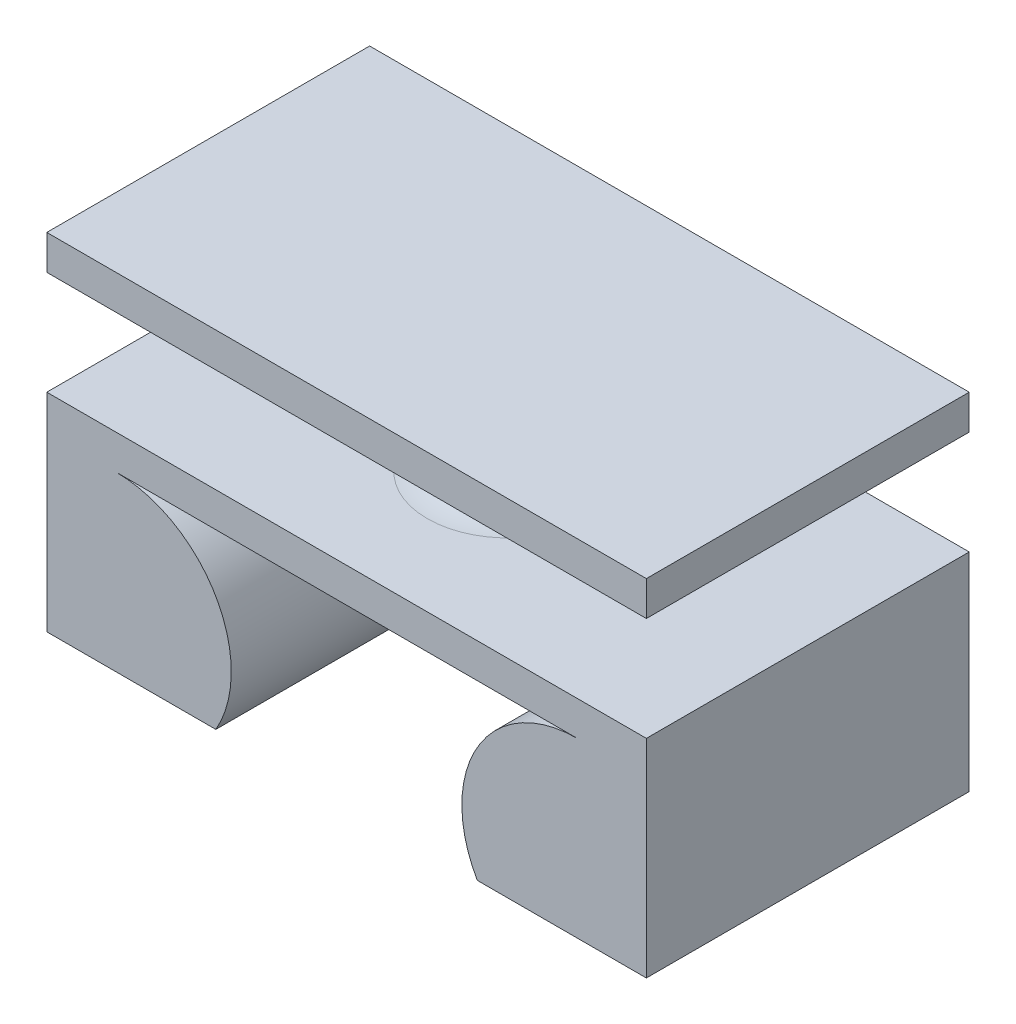
ISO-10303-21;
HEADER;
FILE_DESCRIPTION(('STEP AP214'),'2;1');
FILE_NAME('part.step','',(''),(''),'','','');
FILE_SCHEMA(('AUTOMOTIVE_DESIGN { 1 0 10303 214 1 1 1 1 }'));
ENDSEC;
DATA;
#1=APPLICATION_CONTEXT('core data for automotive mechanical design processes');
#2=APPLICATION_PROTOCOL_DEFINITION('international standard','automotive_design',2000,#1);
#3=PRODUCT_CONTEXT('',#1,'mechanical');
#4=PRODUCT('Part','Part','',(#3));
#5=PRODUCT_RELATED_PRODUCT_CATEGORY('part','',(#4));
#6=PRODUCT_DEFINITION_FORMATION('','',#4);
#7=PRODUCT_DEFINITION_CONTEXT('part definition',#1,'design');
#8=PRODUCT_DEFINITION('design','',#6,#7);
#9=PRODUCT_DEFINITION_SHAPE('','',#8);
#10=(LENGTH_UNIT() NAMED_UNIT(*) SI_UNIT(.MILLI.,.METRE.));
#11=(NAMED_UNIT(*) PLANE_ANGLE_UNIT() SI_UNIT($,.RADIAN.));
#12=(NAMED_UNIT(*) SI_UNIT($,.STERADIAN.) SOLID_ANGLE_UNIT());
#13=UNCERTAINTY_MEASURE_WITH_UNIT(LENGTH_MEASURE(1.E-05),#10,'distance_accuracy_value','');
#14=(GEOMETRIC_REPRESENTATION_CONTEXT(3) GLOBAL_UNCERTAINTY_ASSIGNED_CONTEXT((#13)) GLOBAL_UNIT_ASSIGNED_CONTEXT((#10,
#11,#12)) REPRESENTATION_CONTEXT('',''));
#15=CARTESIAN_POINT('',(0.,0.,0.));
#16=DIRECTION('',(0.,0.,1.));
#17=DIRECTION('',(1.,0.,0.));
#18=AXIS2_PLACEMENT_3D('',#15,#16,#17);
#19=CARTESIAN_POINT('',(5.00000000000001,-0.999999999999966,3.5));
#20=DIRECTION('',(0.,0.,-1.));
#21=DIRECTION('',(-1.,0.,0.));
#22=AXIS2_PLACEMENT_3D('',#19,#20,#21);
#23=CYLINDRICAL_SURFACE('',#22,2.49999999999998);
#24=CARTESIAN_POINT('',(5.00000000000001,-0.999999999999983,-5.));
#25=DIRECTION('',(-0.707106781186547,0.,-0.707106781186547));
#26=DIRECTION('',(0.707106781186547,0.,-0.707106781186547));
#27=AXIS2_PLACEMENT_3D('',#24,#25,#26);
#28=ELLIPSE('',#27,3.53553390593272,2.49999999999999);
#29=CARTESIAN_POINT('',(2.83493649053895,-2.25,-2.8349364905389));
#30=VERTEX_POINT('',#29);
#31=CARTESIAN_POINT('',(3.5,0.999999999999999,-3.5));
#32=VERTEX_POINT('',#31);
#33=EDGE_CURVE('E56',#30,#32,#28,.T.);
#34=ORIENTED_EDGE('',*,*,#33,.F.);
#35=DIRECTION('',(0.,0.,-1.));
#36=VECTOR('',#35,1.);
#37=CARTESIAN_POINT('',(2.83493649053895,-2.25,3.5));
#38=LINE('',#37,#36);
#39=CARTESIAN_POINT('',(2.83493649053895,-2.25,3.5));
#40=VERTEX_POINT('',#39);
#41=EDGE_CURVE('E49',#40,#30,#38,.T.);
#42=ORIENTED_EDGE('',*,*,#41,.F.);
#43=CARTESIAN_POINT('',(5.00000000000001,-0.999999999999966,3.5));
#44=DIRECTION('',(0.,0.,1.));
#45=DIRECTION('',(1.,0.,0.));
#46=AXIS2_PLACEMENT_3D('',#43,#44,#45);
#47=CIRCLE('',#46,2.49999999999998);
#48=CARTESIAN_POINT('',(5.,1.5,3.5));
#49=VERTEX_POINT('',#48);
#50=EDGE_CURVE('E186',#40,#49,#47,.F.);
#51=ORIENTED_EDGE('',*,*,#50,.T.);
#52=DIRECTION('',(0.,0.,-1.));
#53=VECTOR('',#52,1.);
#54=CARTESIAN_POINT('',(5.,1.5,3.5));
#55=LINE('',#54,#53);
#56=CARTESIAN_POINT('',(5.,1.5,-3.5));
#57=VERTEX_POINT('',#56);
#58=EDGE_CURVE('E212',#49,#57,#55,.T.);
#59=ORIENTED_EDGE('',*,*,#58,.T.);
#60=CARTESIAN_POINT('',(5.00000000000001,-0.999999999999966,-3.5));
#61=DIRECTION('',(0.,0.,1.));
#62=DIRECTION('',(1.,0.,0.));
#63=AXIS2_PLACEMENT_3D('',#60,#61,#62);
#64=CIRCLE('',#63,2.49999999999998);
#65=EDGE_CURVE('E185',#32,#57,#64,.F.);
#66=ORIENTED_EDGE('',*,*,#65,.F.);
#67=EDGE_LOOP('',(#34,#42,#51,#59,#66));
#68=FACE_BOUND('',#67,.T.);
#69=ADVANCED_FACE('F41',(#68),#23,.T.);
#70=CARTESIAN_POINT('',(6.5,0.,3.5));
#71=DIRECTION('',(1.,0.,0.));
#72=DIRECTION('',(0.,1.,0.));
#73=AXIS2_PLACEMENT_3D('',#70,#71,#72);
#74=PLANE('',#73);
#75=DIRECTION('',(0.,-1.,0.));
#76=VECTOR('',#75,1.);
#77=CARTESIAN_POINT('',(6.5,0.,-3.5));
#78=LINE('',#77,#76);
#79=CARTESIAN_POINT('',(6.5,2.25,-3.5));
#80=VERTEX_POINT('',#79);
#81=CARTESIAN_POINT('',(6.5,-2.25,-3.5));
#82=VERTEX_POINT('',#81);
#83=EDGE_CURVE('E215',#80,#82,#78,.T.);
#84=ORIENTED_EDGE('',*,*,#83,.F.);
#85=DIRECTION('',(0.,0.,-1.));
#86=VECTOR('',#85,1.);
#87=CARTESIAN_POINT('',(6.5,2.25,3.5));
#88=LINE('',#87,#86);
#89=CARTESIAN_POINT('',(6.5,2.25,3.5));
#90=VERTEX_POINT('',#89);
#91=EDGE_CURVE('E254',#90,#80,#88,.T.);
#92=ORIENTED_EDGE('',*,*,#91,.F.);
#93=DIRECTION('',(0.,-1.,0.));
#94=VECTOR('',#93,1.);
#95=CARTESIAN_POINT('',(6.5,0.,3.5));
#96=LINE('',#95,#94);
#97=CARTESIAN_POINT('',(6.5,-2.25,3.5));
#98=VERTEX_POINT('',#97);
#99=EDGE_CURVE('E195',#90,#98,#96,.T.);
#100=ORIENTED_EDGE('',*,*,#99,.T.);
#101=DIRECTION('',(0.,0.,-1.));
#102=VECTOR('',#101,1.);
#103=CARTESIAN_POINT('',(6.5,-2.25,3.5));
#104=LINE('',#103,#102);
#105=EDGE_CURVE('E257',#98,#82,#104,.T.);
#106=ORIENTED_EDGE('',*,*,#105,.T.);
#107=EDGE_LOOP('',(#84,#92,#100,#106));
#108=FACE_BOUND('',#107,.T.);
#109=ADVANCED_FACE('F294',(#108),#74,.T.);
#110=CARTESIAN_POINT('',(0.,2.25,3.5));
#111=DIRECTION('',(0.,-1.,0.));
#112=DIRECTION('',(1.,0.,0.));
#113=AXIS2_PLACEMENT_3D('',#110,#111,#112);
#114=PLANE('',#113);
#115=CARTESIAN_POINT('',(0.,2.25,0.));
#116=DIRECTION('',(0.,1.,0.));
#117=DIRECTION('',(-1.,0.,0.));
#118=AXIS2_PLACEMENT_3D('',#115,#116,#117);
#119=CIRCLE('',#118,1.75);
#120=CARTESIAN_POINT('',(-1.75,2.25,0.));
#121=VERTEX_POINT('',#120);
#122=EDGE_CURVE('E11',#121,#121,#119,.T.);
#123=ORIENTED_EDGE('',*,*,#122,.F.);
#124=EDGE_LOOP('',(#123));
#125=FACE_BOUND('',#124,.T.);
#126=DIRECTION('',(-1.,0.,0.));
#127=VECTOR('',#126,1.);
#128=CARTESIAN_POINT('',(0.,2.25,-3.5));
#129=LINE('',#128,#127);
#130=CARTESIAN_POINT('',(-6.5,2.25,-3.5));
#131=VERTEX_POINT('',#130);
#132=EDGE_CURVE('E224',#80,#131,#129,.T.);
#133=ORIENTED_EDGE('',*,*,#132,.T.);
#134=DIRECTION('',(0.,0.,-1.));
#135=VECTOR('',#134,1.);
#136=CARTESIAN_POINT('',(-6.5,2.25,3.5));
#137=LINE('',#136,#135);
#138=CARTESIAN_POINT('',(-6.5,2.25,3.5));
#139=VERTEX_POINT('',#138);
#140=EDGE_CURVE('E250',#139,#131,#137,.T.);
#141=ORIENTED_EDGE('',*,*,#140,.F.);
#142=DIRECTION('',(-1.,0.,0.));
#143=VECTOR('',#142,1.);
#144=CARTESIAN_POINT('',(0.,2.25,3.5));
#145=LINE('',#144,#143);
#146=EDGE_CURVE('E200',#90,#139,#145,.T.);
#147=ORIENTED_EDGE('',*,*,#146,.F.);
#148=ORIENTED_EDGE('',*,*,#91,.T.);
#149=EDGE_LOOP('',(#133,#141,#147,#148));
#150=FACE_BOUND('',#149,.T.);
#151=ADVANCED_FACE('F301',(#125,#150),#114,.F.);
#152=CARTESIAN_POINT('',(-6.5,0.,3.5));
#153=DIRECTION('',(1.,0.,0.));
#154=DIRECTION('',(0.,1.,0.));
#155=AXIS2_PLACEMENT_3D('',#152,#153,#154);
#156=PLANE('',#155);
#157=DIRECTION('',(0.,-1.,0.));
#158=VECTOR('',#157,1.);
#159=CARTESIAN_POINT('',(-6.5,0.,-3.5));
#160=LINE('',#159,#158);
#161=CARTESIAN_POINT('',(-6.5,-2.25,-3.5));
#162=VERTEX_POINT('',#161);
#163=EDGE_CURVE('E220',#131,#162,#160,.T.);
#164=ORIENTED_EDGE('',*,*,#163,.T.);
#165=DIRECTION('',(0.,0.,-1.));
#166=VECTOR('',#165,1.);
#167=CARTESIAN_POINT('',(-6.5,-2.25,3.5));
#168=LINE('',#167,#166);
#169=CARTESIAN_POINT('',(-6.5,-2.25,3.5));
#170=VERTEX_POINT('',#169);
#171=EDGE_CURVE('E246',#170,#162,#168,.T.);
#172=ORIENTED_EDGE('',*,*,#171,.F.);
#173=DIRECTION('',(0.,-1.,0.));
#174=VECTOR('',#173,1.);
#175=CARTESIAN_POINT('',(-6.5,0.,3.5));
#176=LINE('',#175,#174);
#177=EDGE_CURVE('E203',#139,#170,#176,.T.);
#178=ORIENTED_EDGE('',*,*,#177,.F.);
#179=ORIENTED_EDGE('',*,*,#140,.T.);
#180=EDGE_LOOP('',(#164,#172,#178,#179));
#181=FACE_BOUND('',#180,.T.);
#182=ADVANCED_FACE('F289',(#181),#156,.F.);
#183=CARTESIAN_POINT('',(0.,-2.25,3.5));
#184=DIRECTION('',(0.,-1.,0.));
#185=DIRECTION('',(1.,0.,0.));
#186=AXIS2_PLACEMENT_3D('',#183,#184,#185);
#187=PLANE('',#186);
#188=DIRECTION('',(1.,0.,0.));
#189=VECTOR('',#188,1.);
#190=CARTESIAN_POINT('',(-3.5,-2.25,-2.8349364905389));
#191=LINE('',#190,#189);
#192=CARTESIAN_POINT('',(-2.8349364905389,-2.25,-2.8349364905389));
#193=VERTEX_POINT('',#192);
#194=EDGE_CURVE('E174',#193,#30,#191,.T.);
#195=ORIENTED_EDGE('',*,*,#194,.F.);
#196=DIRECTION('',(0.,0.,-1.));
#197=VECTOR('',#196,1.);
#198=CARTESIAN_POINT('',(-2.8349364905389,-2.25,3.5));
#199=LINE('',#198,#197);
#200=CARTESIAN_POINT('',(-2.8349364905389,-2.25,3.5));
#201=VERTEX_POINT('',#200);
#202=EDGE_CURVE('E242',#201,#193,#199,.T.);
#203=ORIENTED_EDGE('',*,*,#202,.F.);
#204=DIRECTION('',(-1.,0.,0.));
#205=VECTOR('',#204,1.);
#206=CARTESIAN_POINT('',(0.,-2.25,3.5));
#207=LINE('',#206,#205);
#208=EDGE_CURVE('E196',#201,#170,#207,.T.);
#209=ORIENTED_EDGE('',*,*,#208,.T.);
#210=ORIENTED_EDGE('',*,*,#171,.T.);
#211=DIRECTION('',(-1.,0.,0.));
#212=VECTOR('',#211,1.);
#213=CARTESIAN_POINT('',(0.,-2.25,-3.5));
#214=LINE('',#213,#212);
#215=EDGE_CURVE('E216',#82,#162,#214,.T.);
#216=ORIENTED_EDGE('',*,*,#215,.F.);
#217=ORIENTED_EDGE('',*,*,#105,.F.);
#218=EDGE_CURVE('E190',#98,#40,#207,.T.);
#219=ORIENTED_EDGE('',*,*,#218,.T.);
#220=ORIENTED_EDGE('',*,*,#41,.T.);
#221=EDGE_LOOP('',(#195,#203,#209,#210,#216,#217,#219,#220));
#222=FACE_BOUND('',#221,.T.);
#223=ADVANCED_FACE('F263',(#222),#187,.T.);
#224=CARTESIAN_POINT('',(-5.,-1.,3.5));
#225=DIRECTION('',(0.,0.,-1.));
#226=DIRECTION('',(-1.,0.,0.));
#227=AXIS2_PLACEMENT_3D('',#224,#225,#226);
#228=CYLINDRICAL_SURFACE('',#227,2.5);
#229=ORIENTED_EDGE('',*,*,#202,.T.);
#230=CARTESIAN_POINT('',(-5.,-1.,-5.));
#231=DIRECTION('',(0.707106781186547,0.,-0.707106781186547));
#232=DIRECTION('',(-0.707106781186547,0.,-0.707106781186547));
#233=AXIS2_PLACEMENT_3D('',#230,#231,#232);
#234=ELLIPSE('',#233,3.53553390593274,2.5);
#235=CARTESIAN_POINT('',(-3.5,1.,-3.5));
#236=VERTEX_POINT('',#235);
#237=EDGE_CURVE('E178',#193,#236,#234,.F.);
#238=ORIENTED_EDGE('',*,*,#237,.T.);
#239=CARTESIAN_POINT('',(-5.,-1.,-3.5));
#240=DIRECTION('',(0.,0.,1.));
#241=DIRECTION('',(1.,0.,0.));
#242=AXIS2_PLACEMENT_3D('',#239,#240,#241);
#243=CIRCLE('',#242,2.5);
#244=CARTESIAN_POINT('',(-5.,1.5,-3.5));
#245=VERTEX_POINT('',#244);
#246=EDGE_CURVE('E219',#236,#245,#243,.T.);
#247=ORIENTED_EDGE('',*,*,#246,.T.);
#248=DIRECTION('',(0.,0.,-1.));
#249=VECTOR('',#248,1.);
#250=CARTESIAN_POINT('',(-5.,1.5,3.5));
#251=LINE('',#250,#249);
#252=CARTESIAN_POINT('',(-5.,1.5,3.5));
#253=VERTEX_POINT('',#252);
#254=EDGE_CURVE('E238',#253,#245,#251,.T.);
#255=ORIENTED_EDGE('',*,*,#254,.F.);
#256=CARTESIAN_POINT('',(-5.,-1.,3.5));
#257=DIRECTION('',(0.,0.,1.));
#258=DIRECTION('',(1.,0.,0.));
#259=AXIS2_PLACEMENT_3D('',#256,#257,#258);
#260=CIRCLE('',#259,2.5);
#261=EDGE_CURVE('E206',#201,#253,#260,.T.);
#262=ORIENTED_EDGE('',*,*,#261,.F.);
#263=EDGE_LOOP('',(#229,#238,#247,#255,#262));
#264=FACE_BOUND('',#263,.T.);
#265=ADVANCED_FACE('F269',(#264),#228,.T.);
#266=CARTESIAN_POINT('',(0.,1.5,3.5));
#267=DIRECTION('',(0.,1.,0.));
#268=DIRECTION('',(0.,0.,1.));
#269=AXIS2_PLACEMENT_3D('',#266,#267,#268);
#270=PLANE('',#269);
#271=DIRECTION('',(1.,0.,0.));
#272=VECTOR('',#271,1.);
#273=CARTESIAN_POINT('',(0.,1.5,-3.5));
#274=LINE('',#273,#272);
#275=EDGE_CURVE('E191',#245,#57,#274,.T.);
#276=ORIENTED_EDGE('',*,*,#275,.T.);
#277=ORIENTED_EDGE('',*,*,#58,.F.);
#278=DIRECTION('',(1.,0.,0.));
#279=VECTOR('',#278,1.);
#280=CARTESIAN_POINT('',(0.,1.5,3.5));
#281=LINE('',#280,#279);
#282=EDGE_CURVE('E209',#253,#49,#281,.T.);
#283=ORIENTED_EDGE('',*,*,#282,.F.);
#284=ORIENTED_EDGE('',*,*,#254,.T.);
#285=EDGE_LOOP('',(#276,#277,#283,#284));
#286=FACE_BOUND('',#285,.T.);
#287=ADVANCED_FACE('F278',(#286),#270,.F.);
#288=CARTESIAN_POINT('',(0.,0.,3.5));
#289=DIRECTION('',(0.,0.,1.));
#290=DIRECTION('',(1.,0.,0.));
#291=AXIS2_PLACEMENT_3D('',#288,#289,#290);
#292=PLANE('',#291);
#293=ORIENTED_EDGE('',*,*,#50,.F.);
#294=ORIENTED_EDGE('',*,*,#218,.F.);
#295=ORIENTED_EDGE('',*,*,#99,.F.);
#296=ORIENTED_EDGE('',*,*,#146,.T.);
#297=ORIENTED_EDGE('',*,*,#177,.T.);
#298=ORIENTED_EDGE('',*,*,#208,.F.);
#299=ORIENTED_EDGE('',*,*,#261,.T.);
#300=ORIENTED_EDGE('',*,*,#282,.T.);
#301=EDGE_LOOP('',(#293,#294,#295,#296,#297,#298,#299,#300));
#302=FACE_BOUND('',#301,.T.);
#303=ADVANCED_FACE('F283',(#302),#292,.T.);
#304=CARTESIAN_POINT('',(0.,0.,-3.5));
#305=DIRECTION('',(0.,0.,1.));
#306=DIRECTION('',(1.,0.,0.));
#307=AXIS2_PLACEMENT_3D('',#304,#305,#306);
#308=PLANE('',#307);
#309=DIRECTION('',(1.,0.,0.));
#310=VECTOR('',#309,1.);
#311=CARTESIAN_POINT('',(-3.5,0.999999999999999,-3.5));
#312=LINE('',#311,#310);
#313=EDGE_CURVE('E63',#236,#32,#312,.T.);
#314=ORIENTED_EDGE('',*,*,#313,.T.);
#315=ORIENTED_EDGE('',*,*,#65,.T.);
#316=ORIENTED_EDGE('',*,*,#275,.F.);
#317=ORIENTED_EDGE('',*,*,#246,.F.);
#318=EDGE_LOOP('',(#314,#315,#316,#317));
#319=FACE_BOUND('',#318,.T.);
#320=ORIENTED_EDGE('',*,*,#215,.T.);
#321=ORIENTED_EDGE('',*,*,#163,.F.);
#322=ORIENTED_EDGE('',*,*,#132,.F.);
#323=ORIENTED_EDGE('',*,*,#83,.T.);
#324=EDGE_LOOP('',(#320,#321,#322,#323));
#325=FACE_BOUND('',#324,.T.);
#326=ADVANCED_FACE('F274',(#319,#325),#308,.F.);
#327=CARTESIAN_POINT('',(-3.5,-1.,-5.));
#328=DIRECTION('',(1.,0.,0.));
#329=DIRECTION('',(0.,0.,-1.));
#330=AXIS2_PLACEMENT_3D('',#327,#328,#329);
#331=CYLINDRICAL_SURFACE('',#330,2.5);
#332=ORIENTED_EDGE('',*,*,#194,.T.);
#333=ORIENTED_EDGE('',*,*,#33,.T.);
#334=ORIENTED_EDGE('',*,*,#313,.F.);
#335=ORIENTED_EDGE('',*,*,#237,.F.);
#336=EDGE_LOOP('',(#332,#333,#334,#335));
#337=FACE_BOUND('',#336,.T.);
#338=ADVANCED_FACE('F266',(#337),#331,.T.);
#339=CARTESIAN_POINT('',(0.,3.375,0.));
#340=DIRECTION('',(0.,1.,0.));
#341=DIRECTION('',(-1.,0.,0.));
#342=AXIS2_PLACEMENT_3D('',#339,#340,#341);
#343=TOROIDAL_SURFACE('',#342,1.75,1.125);
#344=CARTESIAN_POINT('',(0.,4.5,0.));
#345=DIRECTION('',(0.,1.,0.));
#346=DIRECTION('',(-1.,0.,0.));
#347=AXIS2_PLACEMENT_3D('',#344,#345,#346);
#348=CIRCLE('',#347,1.75);
#349=CARTESIAN_POINT('',(-1.75,4.5,0.));
#350=VERTEX_POINT('',#349);
#351=EDGE_CURVE('E164',#350,#350,#348,.T.);
#352=ORIENTED_EDGE('',*,*,#351,.F.);
#353=EDGE_LOOP('',(#352));
#354=FACE_BOUND('',#353,.T.);
#355=ORIENTED_EDGE('',*,*,#122,.T.);
#356=EDGE_LOOP('',(#355));
#357=FACE_BOUND('',#356,.T.);
#358=ADVANCED_FACE('F322',(#354,#357),#343,.F.);
#359=CARTESIAN_POINT('',(6.5,5.25,3.5));
#360=DIRECTION('',(-1.,0.,0.));
#361=DIRECTION('',(0.,-1.,0.));
#362=AXIS2_PLACEMENT_3D('',#359,#360,#361);
#363=PLANE('',#362);
#364=DIRECTION('',(0.,0.,-1.));
#365=VECTOR('',#364,1.);
#366=CARTESIAN_POINT('',(6.5,4.5,3.5));
#367=LINE('',#366,#365);
#368=CARTESIAN_POINT('',(6.5,4.5,3.5));
#369=VERTEX_POINT('',#368);
#370=CARTESIAN_POINT('',(6.5,4.5,-3.5));
#371=VERTEX_POINT('',#370);
#372=EDGE_CURVE('E162',#369,#371,#367,.T.);
#373=ORIENTED_EDGE('',*,*,#372,.T.);
#374=DIRECTION('',(0.,-1.,0.));
#375=VECTOR('',#374,1.);
#376=CARTESIAN_POINT('',(6.5,5.25,-3.5));
#377=LINE('',#376,#375);
#378=CARTESIAN_POINT('',(6.5,5.25,-3.5));
#379=VERTEX_POINT('',#378);
#380=EDGE_CURVE('E140',#379,#371,#377,.T.);
#381=ORIENTED_EDGE('',*,*,#380,.F.);
#382=DIRECTION('',(0.,0.,-1.));
#383=VECTOR('',#382,1.);
#384=CARTESIAN_POINT('',(6.5,5.25,3.5));
#385=LINE('',#384,#383);
#386=CARTESIAN_POINT('',(6.5,5.25,3.5));
#387=VERTEX_POINT('',#386);
#388=EDGE_CURVE('E148',#387,#379,#385,.T.);
#389=ORIENTED_EDGE('',*,*,#388,.F.);
#390=DIRECTION('',(0.,-1.,0.));
#391=VECTOR('',#390,1.);
#392=CARTESIAN_POINT('',(6.5,5.25,3.5));
#393=LINE('',#392,#391);
#394=EDGE_CURVE('E467',#387,#369,#393,.T.);
#395=ORIENTED_EDGE('',*,*,#394,.T.);
#396=EDGE_LOOP('',(#373,#381,#389,#395));
#397=FACE_BOUND('',#396,.T.);
#398=ADVANCED_FACE('F160',(#397),#363,.F.);
#399=CARTESIAN_POINT('',(6.5,5.25,-3.5));
#400=DIRECTION('',(0.,0.,1.));
#401=DIRECTION('',(1.,0.,0.));
#402=AXIS2_PLACEMENT_3D('',#399,#400,#401);
#403=PLANE('',#402);
#404=DIRECTION('',(-1.,0.,0.));
#405=VECTOR('',#404,1.);
#406=CARTESIAN_POINT('',(6.5,4.5,-3.5));
#407=LINE('',#406,#405);
#408=CARTESIAN_POINT('',(-6.5,4.5,-3.5));
#409=VERTEX_POINT('',#408);
#410=EDGE_CURVE('E454',#371,#409,#407,.T.);
#411=ORIENTED_EDGE('',*,*,#410,.T.);
#412=DIRECTION('',(0.,-1.,0.));
#413=VECTOR('',#412,1.);
#414=CARTESIAN_POINT('',(-6.5,5.25,-3.5));
#415=LINE('',#414,#413);
#416=CARTESIAN_POINT('',(-6.5,5.25,-3.5));
#417=VERTEX_POINT('',#416);
#418=EDGE_CURVE('E143',#417,#409,#415,.T.);
#419=ORIENTED_EDGE('',*,*,#418,.F.);
#420=DIRECTION('',(-1.,0.,0.));
#421=VECTOR('',#420,1.);
#422=CARTESIAN_POINT('',(6.5,5.25,-3.5));
#423=LINE('',#422,#421);
#424=EDGE_CURVE('E136',#379,#417,#423,.T.);
#425=ORIENTED_EDGE('',*,*,#424,.F.);
#426=ORIENTED_EDGE('',*,*,#380,.T.);
#427=EDGE_LOOP('',(#411,#419,#425,#426));
#428=FACE_BOUND('',#427,.T.);
#429=ADVANCED_FACE('F138',(#428),#403,.F.);
#430=CARTESIAN_POINT('',(-6.5,5.25,-3.5));
#431=DIRECTION('',(1.,0.,0.));
#432=DIRECTION('',(0.,1.,0.));
#433=AXIS2_PLACEMENT_3D('',#430,#431,#432);
#434=PLANE('',#433);
#435=DIRECTION('',(0.,0.,1.));
#436=VECTOR('',#435,1.);
#437=CARTESIAN_POINT('',(-6.5,4.5,-3.5));
#438=LINE('',#437,#436);
#439=CARTESIAN_POINT('',(-6.5,4.5,3.5));
#440=VERTEX_POINT('',#439);
#441=EDGE_CURVE('E458',#409,#440,#438,.T.);
#442=ORIENTED_EDGE('',*,*,#441,.T.);
#443=DIRECTION('',(0.,-1.,0.));
#444=VECTOR('',#443,1.);
#445=CARTESIAN_POINT('',(-6.5,5.25,3.5));
#446=LINE('',#445,#444);
#447=CARTESIAN_POINT('',(-6.5,5.25,3.5));
#448=VERTEX_POINT('',#447);
#449=EDGE_CURVE('E170',#448,#440,#446,.T.);
#450=ORIENTED_EDGE('',*,*,#449,.F.);
#451=DIRECTION('',(0.,0.,1.));
#452=VECTOR('',#451,1.);
#453=CARTESIAN_POINT('',(-6.5,5.25,-3.5));
#454=LINE('',#453,#452);
#455=EDGE_CURVE('E147',#417,#448,#454,.T.);
#456=ORIENTED_EDGE('',*,*,#455,.F.);
#457=ORIENTED_EDGE('',*,*,#418,.T.);
#458=EDGE_LOOP('',(#442,#450,#456,#457));
#459=FACE_BOUND('',#458,.T.);
#460=ADVANCED_FACE('F330',(#459),#434,.F.);
#461=CARTESIAN_POINT('',(-6.5,5.25,3.5));
#462=DIRECTION('',(0.,0.,-1.));
#463=DIRECTION('',(-1.,0.,0.));
#464=AXIS2_PLACEMENT_3D('',#461,#462,#463);
#465=PLANE('',#464);
#466=DIRECTION('',(1.,0.,0.));
#467=VECTOR('',#466,1.);
#468=CARTESIAN_POINT('',(-6.5,4.5,3.5));
#469=LINE('',#468,#467);
#470=EDGE_CURVE('E158',#440,#369,#469,.T.);
#471=ORIENTED_EDGE('',*,*,#470,.T.);
#472=ORIENTED_EDGE('',*,*,#394,.F.);
#473=DIRECTION('',(1.,0.,0.));
#474=VECTOR('',#473,1.);
#475=CARTESIAN_POINT('',(-6.5,5.25,3.5));
#476=LINE('',#475,#474);
#477=EDGE_CURVE('E153',#448,#387,#476,.T.);
#478=ORIENTED_EDGE('',*,*,#477,.F.);
#479=ORIENTED_EDGE('',*,*,#449,.T.);
#480=EDGE_LOOP('',(#471,#472,#478,#479));
#481=FACE_BOUND('',#480,.T.);
#482=ADVANCED_FACE('F333',(#481),#465,.F.);
#483=CARTESIAN_POINT('',(0.,5.25,0.));
#484=DIRECTION('',(0.,1.,0.));
#485=DIRECTION('',(-1.,0.,0.));
#486=AXIS2_PLACEMENT_3D('',#483,#484,#485);
#487=PLANE('',#486);
#488=ORIENTED_EDGE('',*,*,#388,.T.);
#489=ORIENTED_EDGE('',*,*,#424,.T.);
#490=ORIENTED_EDGE('',*,*,#455,.T.);
#491=ORIENTED_EDGE('',*,*,#477,.T.);
#492=EDGE_LOOP('',(#488,#489,#490,#491));
#493=FACE_BOUND('',#492,.T.);
#494=ADVANCED_FACE('F151',(#493),#487,.T.);
#495=CARTESIAN_POINT('',(0.,4.5,0.));
#496=DIRECTION('',(0.,1.,0.));
#497=DIRECTION('',(-1.,0.,0.));
#498=AXIS2_PLACEMENT_3D('',#495,#496,#497);
#499=PLANE('',#498);
#500=ORIENTED_EDGE('',*,*,#351,.T.);
#501=EDGE_LOOP('',(#500));
#502=FACE_BOUND('',#501,.T.);
#503=ORIENTED_EDGE('',*,*,#372,.F.);
#504=ORIENTED_EDGE('',*,*,#470,.F.);
#505=ORIENTED_EDGE('',*,*,#441,.F.);
#506=ORIENTED_EDGE('',*,*,#410,.F.);
#507=EDGE_LOOP('',(#503,#504,#505,#506));
#508=FACE_BOUND('',#507,.T.);
#509=ADVANCED_FACE('F338',(#502,#508),#499,.F.);
#510=CLOSED_SHELL('',(#69,#109,#151,#182,#223,#265,#287,#303,#326,#338,#358,#398,#429,#460,#482,
#494,#509));
#511=MANIFOLD_SOLID_BREP('B2',#510);
#512=ADVANCED_BREP_SHAPE_REPRESENTATION('',(#18,#511),#14);
#513=SHAPE_DEFINITION_REPRESENTATION(#9,#512);
ENDSEC;
END-ISO-10303-21;
